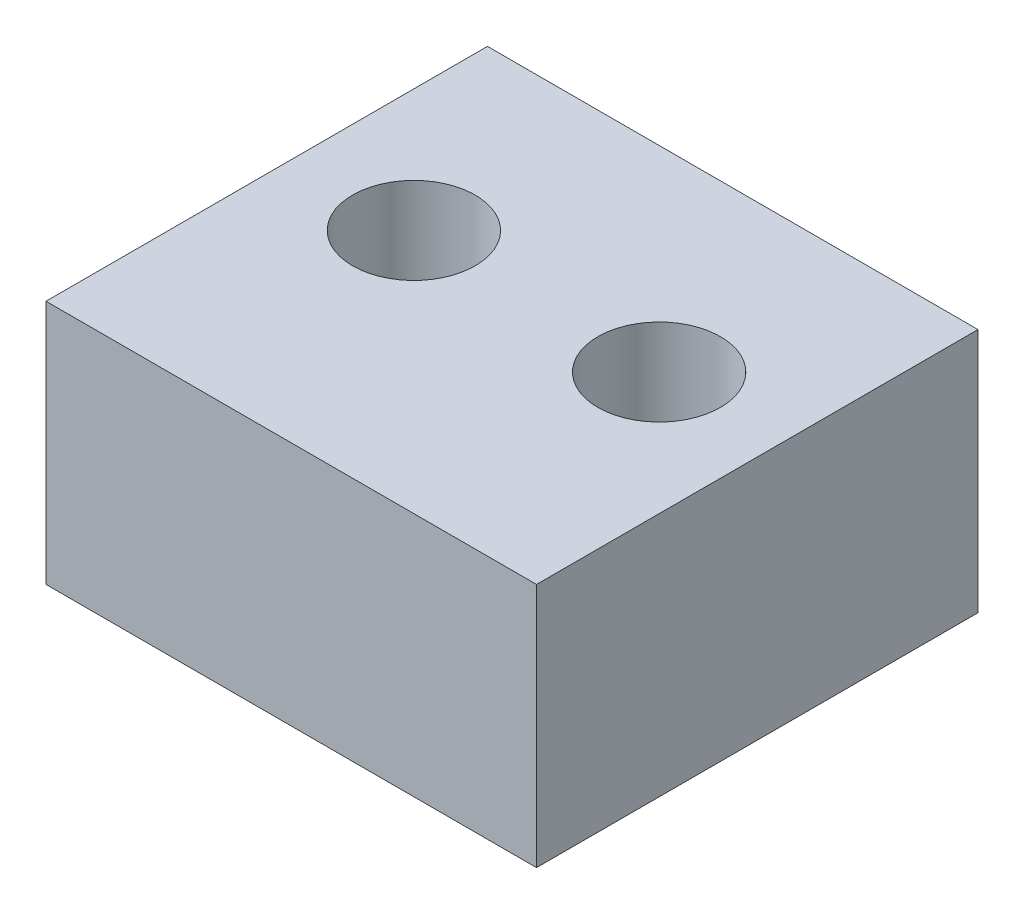
ISO-10303-21;
HEADER;
FILE_DESCRIPTION(('STEP AP214'),'2;1');
FILE_NAME('part.step','',(''),(''),'','','');
FILE_SCHEMA(('AUTOMOTIVE_DESIGN { 1 0 10303 214 1 1 1 1 }'));
ENDSEC;
DATA;
#1=APPLICATION_CONTEXT('core data for automotive mechanical design processes');
#2=APPLICATION_PROTOCOL_DEFINITION('international standard','automotive_design',2000,#1);
#3=PRODUCT_CONTEXT('',#1,'mechanical');
#4=PRODUCT('Part','Part','',(#3));
#5=PRODUCT_RELATED_PRODUCT_CATEGORY('part','',(#4));
#6=PRODUCT_DEFINITION_FORMATION('','',#4);
#7=PRODUCT_DEFINITION_CONTEXT('part definition',#1,'design');
#8=PRODUCT_DEFINITION('design','',#6,#7);
#9=PRODUCT_DEFINITION_SHAPE('','',#8);
#10=(LENGTH_UNIT() NAMED_UNIT(*) SI_UNIT(.MILLI.,.METRE.));
#11=(NAMED_UNIT(*) PLANE_ANGLE_UNIT() SI_UNIT($,.RADIAN.));
#12=(NAMED_UNIT(*) SI_UNIT($,.STERADIAN.) SOLID_ANGLE_UNIT());
#13=UNCERTAINTY_MEASURE_WITH_UNIT(LENGTH_MEASURE(1.E-05),#10,'distance_accuracy_value','');
#14=(GEOMETRIC_REPRESENTATION_CONTEXT(3) GLOBAL_UNCERTAINTY_ASSIGNED_CONTEXT((#13)) GLOBAL_UNIT_ASSIGNED_CONTEXT((#10,
#11,#12)) REPRESENTATION_CONTEXT('',''));
#15=CARTESIAN_POINT('',(0.,0.,0.));
#16=DIRECTION('',(0.,0.,1.));
#17=DIRECTION('',(1.,0.,0.));
#18=AXIS2_PLACEMENT_3D('',#15,#16,#17);
#19=CARTESIAN_POINT('',(12.7,12.7,-11.43));
#20=DIRECTION('',(-1.,0.,0.));
#21=DIRECTION('',(0.,0.,1.));
#22=AXIS2_PLACEMENT_3D('',#19,#20,#21);
#23=PLANE('',#22);
#24=DIRECTION('',(0.,0.,-1.));
#25=VECTOR('',#24,1.);
#26=CARTESIAN_POINT('',(12.7,0.,-11.43));
#27=LINE('',#26,#25);
#28=CARTESIAN_POINT('',(12.7,0.,11.43));
#29=VERTEX_POINT('',#28);
#30=CARTESIAN_POINT('',(12.7,0.,-11.43));
#31=VERTEX_POINT('',#30);
#32=EDGE_CURVE('E98',#29,#31,#27,.T.);
#33=ORIENTED_EDGE('',*,*,#32,.T.);
#34=DIRECTION('',(0.,-1.,0.));
#35=VECTOR('',#34,1.);
#36=CARTESIAN_POINT('',(12.7,12.7,-11.43));
#37=LINE('',#36,#35);
#38=CARTESIAN_POINT('',(12.7,12.7,-11.43));
#39=VERTEX_POINT('',#38);
#40=EDGE_CURVE('E11',#39,#31,#37,.T.);
#41=ORIENTED_EDGE('',*,*,#40,.F.);
#42=DIRECTION('',(0.,0.,-1.));
#43=VECTOR('',#42,1.);
#44=CARTESIAN_POINT('',(12.7,12.7,-11.43));
#45=LINE('',#44,#43);
#46=CARTESIAN_POINT('',(12.7,12.7,11.43));
#47=VERTEX_POINT('',#46);
#48=EDGE_CURVE('E86',#47,#39,#45,.T.);
#49=ORIENTED_EDGE('',*,*,#48,.F.);
#50=DIRECTION('',(0.,-1.,0.));
#51=VECTOR('',#50,1.);
#52=CARTESIAN_POINT('',(12.7,12.7,11.43));
#53=LINE('',#52,#51);
#54=EDGE_CURVE('E94',#47,#29,#53,.T.);
#55=ORIENTED_EDGE('',*,*,#54,.T.);
#56=EDGE_LOOP('',(#33,#41,#49,#55));
#57=FACE_BOUND('',#56,.T.);
#58=ADVANCED_FACE('F35',(#57),#23,.F.);
#59=CARTESIAN_POINT('',(-12.7,12.7,-11.43));
#60=DIRECTION('',(0.,0.,1.));
#61=DIRECTION('',(1.,0.,0.));
#62=AXIS2_PLACEMENT_3D('',#59,#60,#61);
#63=PLANE('',#62);
#64=DIRECTION('',(-1.,0.,0.));
#65=VECTOR('',#64,1.);
#66=CARTESIAN_POINT('',(-12.7,0.,-11.43));
#67=LINE('',#66,#65);
#68=CARTESIAN_POINT('',(-12.7,0.,-11.43));
#69=VERTEX_POINT('',#68);
#70=EDGE_CURVE('E90',#31,#69,#67,.T.);
#71=ORIENTED_EDGE('',*,*,#70,.T.);
#72=DIRECTION('',(0.,-1.,0.));
#73=VECTOR('',#72,1.);
#74=CARTESIAN_POINT('',(-12.7,12.7,-11.43));
#75=LINE('',#74,#73);
#76=CARTESIAN_POINT('',(-12.7,12.7,-11.43));
#77=VERTEX_POINT('',#76);
#78=EDGE_CURVE('E43',#77,#69,#75,.T.);
#79=ORIENTED_EDGE('',*,*,#78,.F.);
#80=DIRECTION('',(-1.,0.,0.));
#81=VECTOR('',#80,1.);
#82=CARTESIAN_POINT('',(-12.7,12.7,-11.43));
#83=LINE('',#82,#81);
#84=EDGE_CURVE('E81',#39,#77,#83,.T.);
#85=ORIENTED_EDGE('',*,*,#84,.F.);
#86=ORIENTED_EDGE('',*,*,#40,.T.);
#87=EDGE_LOOP('',(#71,#79,#85,#86));
#88=FACE_BOUND('',#87,.T.);
#89=ADVANCED_FACE('F89',(#88),#63,.F.);
#90=CARTESIAN_POINT('',(-12.7,12.7,-11.43));
#91=DIRECTION('',(1.,0.,0.));
#92=DIRECTION('',(0.,0.,-1.));
#93=AXIS2_PLACEMENT_3D('',#90,#91,#92);
#94=PLANE('',#93);
#95=DIRECTION('',(0.,0.,1.));
#96=VECTOR('',#95,1.);
#97=CARTESIAN_POINT('',(-12.7,0.,-11.43));
#98=LINE('',#97,#96);
#99=CARTESIAN_POINT('',(-12.7,0.,11.43));
#100=VERTEX_POINT('',#99);
#101=EDGE_CURVE('E68',#69,#100,#98,.T.);
#102=ORIENTED_EDGE('',*,*,#101,.T.);
#103=DIRECTION('',(0.,-1.,0.));
#104=VECTOR('',#103,1.);
#105=CARTESIAN_POINT('',(-12.7,12.7,11.43));
#106=LINE('',#105,#104);
#107=CARTESIAN_POINT('',(-12.7,12.7,11.43));
#108=VERTEX_POINT('',#107);
#109=EDGE_CURVE('E91',#108,#100,#106,.T.);
#110=ORIENTED_EDGE('',*,*,#109,.F.);
#111=DIRECTION('',(0.,0.,1.));
#112=VECTOR('',#111,1.);
#113=CARTESIAN_POINT('',(-12.7,12.7,-11.43));
#114=LINE('',#113,#112);
#115=EDGE_CURVE('E84',#77,#108,#114,.T.);
#116=ORIENTED_EDGE('',*,*,#115,.F.);
#117=ORIENTED_EDGE('',*,*,#78,.T.);
#118=EDGE_LOOP('',(#102,#110,#116,#117));
#119=FACE_BOUND('',#118,.T.);
#120=ADVANCED_FACE('F92',(#119),#94,.F.);
#121=CARTESIAN_POINT('',(-12.7,12.7,11.43));
#122=DIRECTION('',(0.,0.,-1.));
#123=DIRECTION('',(-1.,0.,0.));
#124=AXIS2_PLACEMENT_3D('',#121,#122,#123);
#125=PLANE('',#124);
#126=DIRECTION('',(1.,0.,0.));
#127=VECTOR('',#126,1.);
#128=CARTESIAN_POINT('',(-12.7,0.,11.43));
#129=LINE('',#128,#127);
#130=EDGE_CURVE('E74',#100,#29,#129,.T.);
#131=ORIENTED_EDGE('',*,*,#130,.T.);
#132=ORIENTED_EDGE('',*,*,#54,.F.);
#133=DIRECTION('',(1.,0.,0.));
#134=VECTOR('',#133,1.);
#135=CARTESIAN_POINT('',(-12.7,12.7,11.43));
#136=LINE('',#135,#134);
#137=EDGE_CURVE('E51',#108,#47,#136,.T.);
#138=ORIENTED_EDGE('',*,*,#137,.F.);
#139=ORIENTED_EDGE('',*,*,#109,.T.);
#140=EDGE_LOOP('',(#131,#132,#138,#139));
#141=FACE_BOUND('',#140,.T.);
#142=ADVANCED_FACE('F106',(#141),#125,.F.);
#143=CARTESIAN_POINT('',(0.,12.7,0.));
#144=DIRECTION('',(0.,1.,0.));
#145=DIRECTION('',(0.,0.,1.));
#146=AXIS2_PLACEMENT_3D('',#143,#144,#145);
#147=PLANE('',#146);
#148=CARTESIAN_POINT('',(-6.35,12.7,-1.27));
#149=DIRECTION('',(0.,1.,0.));
#150=DIRECTION('',(0.,0.,1.));
#151=AXIS2_PLACEMENT_3D('',#148,#149,#150);
#152=CIRCLE('',#151,3.175);
#153=CARTESIAN_POINT('',(-6.35,12.7,1.905));
#154=VERTEX_POINT('',#153);
#155=EDGE_CURVE('E120',#154,#154,#152,.T.);
#156=ORIENTED_EDGE('',*,*,#155,.F.);
#157=EDGE_LOOP('',(#156));
#158=FACE_BOUND('',#157,.T.);
#159=CARTESIAN_POINT('',(6.35000000000001,12.7,-1.27));
#160=DIRECTION('',(0.,1.,0.));
#161=DIRECTION('',(0.,0.,1.));
#162=AXIS2_PLACEMENT_3D('',#159,#160,#161);
#163=CIRCLE('',#162,3.175);
#164=CARTESIAN_POINT('',(6.35000000000001,12.7,1.905));
#165=VERTEX_POINT('',#164);
#166=EDGE_CURVE('E114',#165,#165,#163,.T.);
#167=ORIENTED_EDGE('',*,*,#166,.F.);
#168=EDGE_LOOP('',(#167));
#169=FACE_BOUND('',#168,.T.);
#170=ORIENTED_EDGE('',*,*,#48,.T.);
#171=ORIENTED_EDGE('',*,*,#84,.T.);
#172=ORIENTED_EDGE('',*,*,#115,.T.);
#173=ORIENTED_EDGE('',*,*,#137,.T.);
#174=EDGE_LOOP('',(#170,#171,#172,#173));
#175=FACE_BOUND('',#174,.T.);
#176=ADVANCED_FACE('F82',(#158,#169,#175),#147,.T.);
#177=CARTESIAN_POINT('',(0.,0.,0.));
#178=DIRECTION('',(0.,1.,0.));
#179=DIRECTION('',(0.,0.,1.));
#180=AXIS2_PLACEMENT_3D('',#177,#178,#179);
#181=PLANE('',#180);
#182=CARTESIAN_POINT('',(-6.35,0.,-1.27));
#183=DIRECTION('',(0.,1.,0.));
#184=DIRECTION('',(0.,0.,1.));
#185=AXIS2_PLACEMENT_3D('',#182,#183,#184);
#186=CIRCLE('',#185,3.175);
#187=CARTESIAN_POINT('',(-6.35,0.,1.905));
#188=VERTEX_POINT('',#187);
#189=EDGE_CURVE('E117',#188,#188,#186,.T.);
#190=ORIENTED_EDGE('',*,*,#189,.T.);
#191=EDGE_LOOP('',(#190));
#192=FACE_BOUND('',#191,.T.);
#193=CARTESIAN_POINT('',(6.35000000000001,0.,-1.27));
#194=DIRECTION('',(0.,1.,0.));
#195=DIRECTION('',(0.,0.,1.));
#196=AXIS2_PLACEMENT_3D('',#193,#194,#195);
#197=CIRCLE('',#196,3.175);
#198=CARTESIAN_POINT('',(6.35000000000001,0.,1.905));
#199=VERTEX_POINT('',#198);
#200=EDGE_CURVE('E101',#199,#199,#197,.T.);
#201=ORIENTED_EDGE('',*,*,#200,.T.);
#202=EDGE_LOOP('',(#201));
#203=FACE_BOUND('',#202,.T.);
#204=ORIENTED_EDGE('',*,*,#32,.F.);
#205=ORIENTED_EDGE('',*,*,#130,.F.);
#206=ORIENTED_EDGE('',*,*,#101,.F.);
#207=ORIENTED_EDGE('',*,*,#70,.F.);
#208=EDGE_LOOP('',(#204,#205,#206,#207));
#209=FACE_BOUND('',#208,.T.);
#210=ADVANCED_FACE('F109',(#192,#203,#209),#181,.F.);
#211=CARTESIAN_POINT('',(6.35000000000001,12.7,-1.27));
#212=DIRECTION('',(0.,1.,0.));
#213=DIRECTION('',(0.,0.,1.));
#214=AXIS2_PLACEMENT_3D('',#211,#212,#213);
#215=CYLINDRICAL_SURFACE('',#214,3.175);
#216=ORIENTED_EDGE('',*,*,#200,.F.);
#217=EDGE_LOOP('',(#216));
#218=FACE_BOUND('',#217,.T.);
#219=ORIENTED_EDGE('',*,*,#166,.T.);
#220=EDGE_LOOP('',(#219));
#221=FACE_BOUND('',#220,.T.);
#222=ADVANCED_FACE('F131',(#218,#221),#215,.F.);
#223=CARTESIAN_POINT('',(-6.35,12.7,-1.27));
#224=DIRECTION('',(0.,1.,0.));
#225=DIRECTION('',(0.,0.,1.));
#226=AXIS2_PLACEMENT_3D('',#223,#224,#225);
#227=CYLINDRICAL_SURFACE('',#226,3.175);
#228=ORIENTED_EDGE('',*,*,#189,.F.);
#229=EDGE_LOOP('',(#228));
#230=FACE_BOUND('',#229,.T.);
#231=ORIENTED_EDGE('',*,*,#155,.T.);
#232=EDGE_LOOP('',(#231));
#233=FACE_BOUND('',#232,.T.);
#234=ADVANCED_FACE('F124',(#230,#233),#227,.F.);
#235=CLOSED_SHELL('',(#58,#89,#120,#142,#176,#210,#222,#234));
#236=MANIFOLD_SOLID_BREP('B2',#235);
#237=ADVANCED_BREP_SHAPE_REPRESENTATION('',(#18,#236),#14);
#238=SHAPE_DEFINITION_REPRESENTATION(#9,#237);
ENDSEC;
END-ISO-10303-21;
